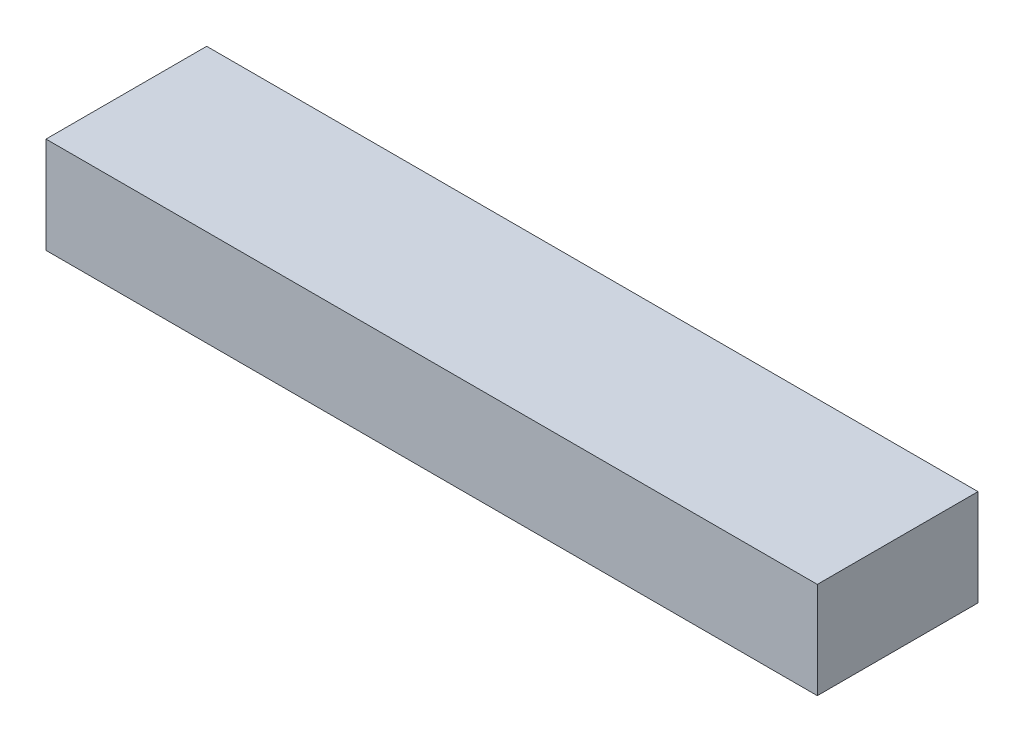
ISO-10303-21;
HEADER;
FILE_DESCRIPTION(('STEP AP214'),'2;1');
FILE_NAME('part.step','',(''),(''),'','','');
FILE_SCHEMA(('AUTOMOTIVE_DESIGN { 1 0 10303 214 1 1 1 1 }'));
ENDSEC;
DATA;
#1=APPLICATION_CONTEXT('core data for automotive mechanical design processes');
#2=APPLICATION_PROTOCOL_DEFINITION('international standard','automotive_design',2000,#1);
#3=PRODUCT_CONTEXT('',#1,'mechanical');
#4=PRODUCT('Part','Part','',(#3));
#5=PRODUCT_RELATED_PRODUCT_CATEGORY('part','',(#4));
#6=PRODUCT_DEFINITION_FORMATION('','',#4);
#7=PRODUCT_DEFINITION_CONTEXT('part definition',#1,'design');
#8=PRODUCT_DEFINITION('design','',#6,#7);
#9=PRODUCT_DEFINITION_SHAPE('','',#8);
#10=(LENGTH_UNIT() NAMED_UNIT(*) SI_UNIT(.MILLI.,.METRE.));
#11=(NAMED_UNIT(*) PLANE_ANGLE_UNIT() SI_UNIT($,.RADIAN.));
#12=(NAMED_UNIT(*) SI_UNIT($,.STERADIAN.) SOLID_ANGLE_UNIT());
#13=UNCERTAINTY_MEASURE_WITH_UNIT(LENGTH_MEASURE(1.E-05),#10,'distance_accuracy_value','');
#14=(GEOMETRIC_REPRESENTATION_CONTEXT(3) GLOBAL_UNCERTAINTY_ASSIGNED_CONTEXT((#13)) GLOBAL_UNIT_ASSIGNED_CONTEXT((#10,
#11,#12)) REPRESENTATION_CONTEXT('',''));
#15=CARTESIAN_POINT('',(0.,0.,0.));
#16=DIRECTION('',(0.,0.,1.));
#17=DIRECTION('',(1.,0.,0.));
#18=AXIS2_PLACEMENT_3D('',#15,#16,#17);
#19=CARTESIAN_POINT('',(304.8,0.,0.));
#20=DIRECTION('',(0.,0.,-1.));
#21=DIRECTION('',(-1.,0.,0.));
#22=AXIS2_PLACEMENT_3D('',#19,#20,#21);
#23=PLANE('',#22);
#24=DIRECTION('',(0.,-1.,0.));
#25=VECTOR('',#24,1.);
#26=CARTESIAN_POINT('',(0.,0.,0.));
#27=LINE('',#26,#25);
#28=CARTESIAN_POINT('',(0.,0.,0.));
#29=VERTEX_POINT('',#28);
#30=CARTESIAN_POINT('',(0.,-38.1,0.));
#31=VERTEX_POINT('',#30);
#32=EDGE_CURVE('E95',#29,#31,#27,.T.);
#33=ORIENTED_EDGE('',*,*,#32,.T.);
#34=DIRECTION('',(-1.,0.,0.));
#35=VECTOR('',#34,1.);
#36=CARTESIAN_POINT('',(304.8,-38.1,0.));
#37=LINE('',#36,#35);
#38=CARTESIAN_POINT('',(304.8,-38.1,0.));
#39=VERTEX_POINT('',#38);
#40=EDGE_CURVE('E11',#39,#31,#37,.T.);
#41=ORIENTED_EDGE('',*,*,#40,.F.);
#42=DIRECTION('',(0.,-1.,0.));
#43=VECTOR('',#42,1.);
#44=CARTESIAN_POINT('',(304.8,0.,0.));
#45=LINE('',#44,#43);
#46=CARTESIAN_POINT('',(304.8,0.,0.));
#47=VERTEX_POINT('',#46);
#48=EDGE_CURVE('E83',#47,#39,#45,.T.);
#49=ORIENTED_EDGE('',*,*,#48,.F.);
#50=DIRECTION('',(-1.,0.,0.));
#51=VECTOR('',#50,1.);
#52=CARTESIAN_POINT('',(304.8,0.,0.));
#53=LINE('',#52,#51);
#54=EDGE_CURVE('E91',#47,#29,#53,.T.);
#55=ORIENTED_EDGE('',*,*,#54,.T.);
#56=EDGE_LOOP('',(#33,#41,#49,#55));
#57=FACE_BOUND('',#56,.T.);
#58=ADVANCED_FACE('F32',(#57),#23,.F.);
#59=CARTESIAN_POINT('',(304.8,-38.1,0.));
#60=DIRECTION('',(0.,1.,0.));
#61=DIRECTION('',(0.,0.,1.));
#62=AXIS2_PLACEMENT_3D('',#59,#60,#61);
#63=PLANE('',#62);
#64=DIRECTION('',(0.,0.,-1.));
#65=VECTOR('',#64,1.);
#66=CARTESIAN_POINT('',(0.,-38.1,0.));
#67=LINE('',#66,#65);
#68=CARTESIAN_POINT('',(0.,-38.1,-63.5));
#69=VERTEX_POINT('',#68);
#70=EDGE_CURVE('E87',#31,#69,#67,.T.);
#71=ORIENTED_EDGE('',*,*,#70,.T.);
#72=DIRECTION('',(-1.,0.,0.));
#73=VECTOR('',#72,1.);
#74=CARTESIAN_POINT('',(304.8,-38.1,-63.5));
#75=LINE('',#74,#73);
#76=CARTESIAN_POINT('',(304.8,-38.1,-63.5));
#77=VERTEX_POINT('',#76);
#78=EDGE_CURVE('E40',#77,#69,#75,.T.);
#79=ORIENTED_EDGE('',*,*,#78,.F.);
#80=DIRECTION('',(0.,0.,-1.));
#81=VECTOR('',#80,1.);
#82=CARTESIAN_POINT('',(304.8,-38.1,0.));
#83=LINE('',#82,#81);
#84=EDGE_CURVE('E78',#39,#77,#83,.T.);
#85=ORIENTED_EDGE('',*,*,#84,.F.);
#86=ORIENTED_EDGE('',*,*,#40,.T.);
#87=EDGE_LOOP('',(#71,#79,#85,#86));
#88=FACE_BOUND('',#87,.T.);
#89=ADVANCED_FACE('F86',(#88),#63,.F.);
#90=CARTESIAN_POINT('',(304.8,0.,-63.5));
#91=DIRECTION('',(0.,0.,1.));
#92=DIRECTION('',(0.,-1.,0.));
#93=AXIS2_PLACEMENT_3D('',#90,#91,#92);
#94=PLANE('',#93);
#95=DIRECTION('',(0.,1.,0.));
#96=VECTOR('',#95,1.);
#97=CARTESIAN_POINT('',(0.,0.,-63.5));
#98=LINE('',#97,#96);
#99=CARTESIAN_POINT('',(0.,0.,-63.5));
#100=VERTEX_POINT('',#99);
#101=EDGE_CURVE('E65',#69,#100,#98,.T.);
#102=ORIENTED_EDGE('',*,*,#101,.T.);
#103=DIRECTION('',(-1.,0.,0.));
#104=VECTOR('',#103,1.);
#105=CARTESIAN_POINT('',(304.8,0.,-63.5));
#106=LINE('',#105,#104);
#107=CARTESIAN_POINT('',(304.8,0.,-63.5));
#108=VERTEX_POINT('',#107);
#109=EDGE_CURVE('E88',#108,#100,#106,.T.);
#110=ORIENTED_EDGE('',*,*,#109,.F.);
#111=DIRECTION('',(0.,1.,0.));
#112=VECTOR('',#111,1.);
#113=CARTESIAN_POINT('',(304.8,0.,-63.5));
#114=LINE('',#113,#112);
#115=EDGE_CURVE('E81',#77,#108,#114,.T.);
#116=ORIENTED_EDGE('',*,*,#115,.F.);
#117=ORIENTED_EDGE('',*,*,#78,.T.);
#118=EDGE_LOOP('',(#102,#110,#116,#117));
#119=FACE_BOUND('',#118,.T.);
#120=ADVANCED_FACE('F89',(#119),#94,.F.);
#121=CARTESIAN_POINT('',(304.8,0.,0.));
#122=DIRECTION('',(0.,-1.,0.));
#123=DIRECTION('',(0.,0.,-1.));
#124=AXIS2_PLACEMENT_3D('',#121,#122,#123);
#125=PLANE('',#124);
#126=DIRECTION('',(0.,0.,1.));
#127=VECTOR('',#126,1.);
#128=CARTESIAN_POINT('',(0.,0.,0.));
#129=LINE('',#128,#127);
#130=EDGE_CURVE('E71',#100,#29,#129,.T.);
#131=ORIENTED_EDGE('',*,*,#130,.T.);
#132=ORIENTED_EDGE('',*,*,#54,.F.);
#133=DIRECTION('',(0.,0.,1.));
#134=VECTOR('',#133,1.);
#135=CARTESIAN_POINT('',(304.8,0.,0.));
#136=LINE('',#135,#134);
#137=EDGE_CURVE('E48',#108,#47,#136,.T.);
#138=ORIENTED_EDGE('',*,*,#137,.F.);
#139=ORIENTED_EDGE('',*,*,#109,.T.);
#140=EDGE_LOOP('',(#131,#132,#138,#139));
#141=FACE_BOUND('',#140,.T.);
#142=ADVANCED_FACE('F102',(#141),#125,.F.);
#143=CARTESIAN_POINT('',(304.8,0.,0.));
#144=DIRECTION('',(1.,0.,0.));
#145=DIRECTION('',(0.,0.,-1.));
#146=AXIS2_PLACEMENT_3D('',#143,#144,#145);
#147=PLANE('',#146);
#148=ORIENTED_EDGE('',*,*,#48,.T.);
#149=ORIENTED_EDGE('',*,*,#84,.T.);
#150=ORIENTED_EDGE('',*,*,#115,.T.);
#151=ORIENTED_EDGE('',*,*,#137,.T.);
#152=EDGE_LOOP('',(#148,#149,#150,#151));
#153=FACE_BOUND('',#152,.T.);
#154=ADVANCED_FACE('F79',(#153),#147,.T.);
#155=CARTESIAN_POINT('',(0.,0.,0.));
#156=DIRECTION('',(1.,0.,0.));
#157=DIRECTION('',(0.,0.,-1.));
#158=AXIS2_PLACEMENT_3D('',#155,#156,#157);
#159=PLANE('',#158);
#160=ORIENTED_EDGE('',*,*,#32,.F.);
#161=ORIENTED_EDGE('',*,*,#130,.F.);
#162=ORIENTED_EDGE('',*,*,#101,.F.);
#163=ORIENTED_EDGE('',*,*,#70,.F.);
#164=EDGE_LOOP('',(#160,#161,#162,#163));
#165=FACE_BOUND('',#164,.T.);
#166=ADVANCED_FACE('F105',(#165),#159,.F.);
#167=CLOSED_SHELL('',(#58,#89,#120,#142,#154,#166));
#168=MANIFOLD_SOLID_BREP('B2',#167);
#169=ADVANCED_BREP_SHAPE_REPRESENTATION('',(#18,#168),#14);
#170=SHAPE_DEFINITION_REPRESENTATION(#9,#169);
ENDSEC;
END-ISO-10303-21;
